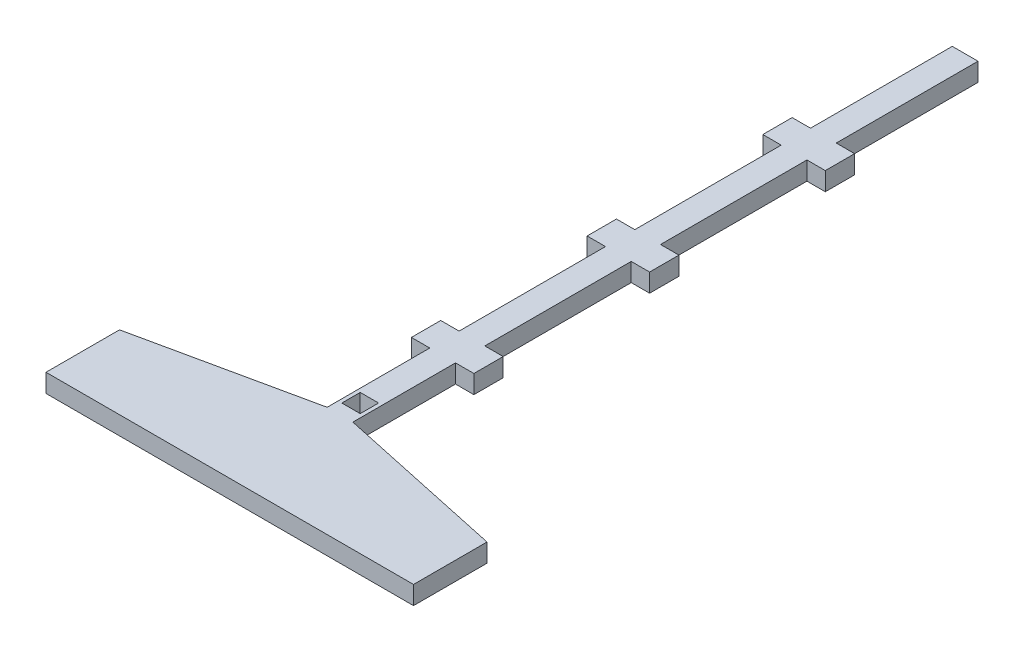
ISO-10303-21;
HEADER;
FILE_DESCRIPTION(('STEP AP214'),'2;1');
FILE_NAME('part.step','',(''),(''),'','','');
FILE_SCHEMA(('AUTOMOTIVE_DESIGN { 1 0 10303 214 1 1 1 1 }'));
ENDSEC;
DATA;
#1=APPLICATION_CONTEXT('core data for automotive mechanical design processes');
#2=APPLICATION_PROTOCOL_DEFINITION('international standard','automotive_design',2000,#1);
#3=PRODUCT_CONTEXT('',#1,'mechanical');
#4=PRODUCT('Part','Part','',(#3));
#5=PRODUCT_RELATED_PRODUCT_CATEGORY('part','',(#4));
#6=PRODUCT_DEFINITION_FORMATION('','',#4);
#7=PRODUCT_DEFINITION_CONTEXT('part definition',#1,'design');
#8=PRODUCT_DEFINITION('design','',#6,#7);
#9=PRODUCT_DEFINITION_SHAPE('','',#8);
#10=(LENGTH_UNIT() NAMED_UNIT(*) SI_UNIT(.MILLI.,.METRE.));
#11=(NAMED_UNIT(*) PLANE_ANGLE_UNIT() SI_UNIT($,.RADIAN.));
#12=(NAMED_UNIT(*) SI_UNIT($,.STERADIAN.) SOLID_ANGLE_UNIT());
#13=UNCERTAINTY_MEASURE_WITH_UNIT(LENGTH_MEASURE(1.E-05),#10,'distance_accuracy_value','');
#14=(GEOMETRIC_REPRESENTATION_CONTEXT(3) GLOBAL_UNCERTAINTY_ASSIGNED_CONTEXT((#13)) GLOBAL_UNIT_ASSIGNED_CONTEXT((#10,
#11,#12)) REPRESENTATION_CONTEXT('',''));
#15=CARTESIAN_POINT('',(0.,0.,0.));
#16=DIRECTION('',(0.,0.,1.));
#17=DIRECTION('',(1.,0.,0.));
#18=AXIS2_PLACEMENT_3D('',#15,#16,#17);
#19=CARTESIAN_POINT('',(0.,6.35,0.));
#20=DIRECTION('',(0.,1.,0.));
#21=DIRECTION('',(0.,0.,1.));
#22=AXIS2_PLACEMENT_3D('',#19,#20,#21);
#23=PLANE('',#22);
#24=DIRECTION('',(0.,0.,1.));
#25=VECTOR('',#24,1.);
#26=CARTESIAN_POINT('',(0.,6.35,0.));
#27=LINE('',#26,#25);
#28=CARTESIAN_POINT('',(0.,6.35,-25.4));
#29=VERTEX_POINT('',#28);
#30=CARTESIAN_POINT('',(0.,6.35,0.));
#31=VERTEX_POINT('',#30);
#32=EDGE_CURVE('E302',#29,#31,#27,.T.);
#33=ORIENTED_EDGE('',*,*,#32,.T.);
#34=DIRECTION('',(1.,0.,0.));
#35=VECTOR('',#34,1.);
#36=CARTESIAN_POINT('',(0.,6.35,0.));
#37=LINE('',#36,#35);
#38=CARTESIAN_POINT('',(127.,6.35,0.));
#39=VERTEX_POINT('',#38);
#40=EDGE_CURVE('E305',#31,#39,#37,.T.);
#41=ORIENTED_EDGE('',*,*,#40,.T.);
#42=DIRECTION('',(0.,0.,-1.));
#43=VECTOR('',#42,1.);
#44=CARTESIAN_POINT('',(127.,6.35,0.));
#45=LINE('',#44,#43);
#46=CARTESIAN_POINT('',(127.,6.35,-25.4));
#47=VERTEX_POINT('',#46);
#48=EDGE_CURVE('E308',#39,#47,#45,.T.);
#49=ORIENTED_EDGE('',*,*,#48,.T.);
#50=DIRECTION('',(-0.977648311294435,0.,-0.21024694866547));
#51=VECTOR('',#50,1.);
#52=CARTESIAN_POINT('',(67.945,6.35,-38.1));
#53=LINE('',#52,#51);
#54=CARTESIAN_POINT('',(67.945,6.35,-38.1));
#55=VERTEX_POINT('',#54);
#56=EDGE_CURVE('E310',#47,#55,#53,.T.);
#57=ORIENTED_EDGE('',*,*,#56,.T.);
#58=DIRECTION('',(0.,0.,-1.));
#59=VECTOR('',#58,1.);
#60=CARTESIAN_POINT('',(67.945,6.35,-38.1));
#61=LINE('',#60,#59);
#62=CARTESIAN_POINT('',(67.945,6.35,-73.566782));
#63=VERTEX_POINT('',#62);
#64=EDGE_CURVE('E312',#55,#63,#61,.T.);
#65=ORIENTED_EDGE('',*,*,#64,.T.);
#66=DIRECTION('',(1.,0.,0.));
#67=VECTOR('',#66,1.);
#68=CARTESIAN_POINT('',(67.945,6.35,-73.566782));
#69=LINE('',#68,#67);
#70=CARTESIAN_POINT('',(74.295,6.35,-73.566782));
#71=VERTEX_POINT('',#70);
#72=EDGE_CURVE('E314',#63,#71,#69,.T.);
#73=ORIENTED_EDGE('',*,*,#72,.T.);
#74=DIRECTION('',(0.,0.,-1.));
#75=VECTOR('',#74,1.);
#76=CARTESIAN_POINT('',(74.295,6.35,-73.566782));
#77=LINE('',#76,#75);
#78=CARTESIAN_POINT('',(74.295,6.35,-83.698651246));
#79=VERTEX_POINT('',#78);
#80=EDGE_CURVE('E316',#71,#79,#77,.T.);
#81=ORIENTED_EDGE('',*,*,#80,.T.);
#82=DIRECTION('',(-1.,0.,0.));
#83=VECTOR('',#82,1.);
#84=CARTESIAN_POINT('',(74.295,6.35,-83.698651246));
#85=LINE('',#84,#83);
#86=CARTESIAN_POINT('',(67.945,6.35,-83.698651246));
#87=VERTEX_POINT('',#86);
#88=EDGE_CURVE('E318',#79,#87,#85,.T.);
#89=ORIENTED_EDGE('',*,*,#88,.T.);
#90=DIRECTION('',(0.,0.,-1.));
#91=VECTOR('',#90,1.);
#92=CARTESIAN_POINT('',(67.945,6.35,-83.698651246));
#93=LINE('',#92,#91);
#94=CARTESIAN_POINT('',(67.945,6.35,-134.288657));
#95=VERTEX_POINT('',#94);
#96=EDGE_CURVE('E320',#87,#95,#93,.T.);
#97=ORIENTED_EDGE('',*,*,#96,.T.);
#98=DIRECTION('',(1.,0.,0.));
#99=VECTOR('',#98,1.);
#100=CARTESIAN_POINT('',(67.945,6.35,-134.288657));
#101=LINE('',#100,#99);
#102=CARTESIAN_POINT('',(74.295,6.35,-134.288657));
#103=VERTEX_POINT('',#102);
#104=EDGE_CURVE('E322',#95,#103,#101,.T.);
#105=ORIENTED_EDGE('',*,*,#104,.T.);
#106=DIRECTION('',(0.,0.,-1.));
#107=VECTOR('',#106,1.);
#108=CARTESIAN_POINT('',(74.295,6.35,-134.288657));
#109=LINE('',#108,#107);
#110=CARTESIAN_POINT('',(74.295,6.35,-144.420526246));
#111=VERTEX_POINT('',#110);
#112=EDGE_CURVE('E324',#103,#111,#109,.T.);
#113=ORIENTED_EDGE('',*,*,#112,.T.);
#114=DIRECTION('',(-1.,0.,0.));
#115=VECTOR('',#114,1.);
#116=CARTESIAN_POINT('',(74.295,6.35,-144.420526246));
#117=LINE('',#116,#115);
#118=CARTESIAN_POINT('',(67.945,6.35,-144.420526246));
#119=VERTEX_POINT('',#118);
#120=EDGE_CURVE('E326',#111,#119,#117,.T.);
#121=ORIENTED_EDGE('',*,*,#120,.T.);
#122=DIRECTION('',(0.,0.,-1.));
#123=VECTOR('',#122,1.);
#124=CARTESIAN_POINT('',(67.945,6.35,-144.420526246));
#125=LINE('',#124,#123);
#126=CARTESIAN_POINT('',(67.945,6.35,-195.010544446));
#127=VERTEX_POINT('',#126);
#128=EDGE_CURVE('E328',#119,#127,#125,.T.);
#129=ORIENTED_EDGE('',*,*,#128,.T.);
#130=DIRECTION('',(1.,0.,0.));
#131=VECTOR('',#130,1.);
#132=CARTESIAN_POINT('',(67.945,6.35,-195.010544446));
#133=LINE('',#132,#131);
#134=CARTESIAN_POINT('',(74.295,6.35,-195.010544446));
#135=VERTEX_POINT('',#134);
#136=EDGE_CURVE('E330',#127,#135,#133,.T.);
#137=ORIENTED_EDGE('',*,*,#136,.T.);
#138=DIRECTION('',(0.,0.,-1.));
#139=VECTOR('',#138,1.);
#140=CARTESIAN_POINT('',(74.295,6.35,-195.010544446));
#141=LINE('',#140,#139);
#142=CARTESIAN_POINT('',(74.295,6.35,-205.142413692));
#143=VERTEX_POINT('',#142);
#144=EDGE_CURVE('E332',#135,#143,#141,.T.);
#145=ORIENTED_EDGE('',*,*,#144,.T.);
#146=DIRECTION('',(-1.,0.,0.));
#147=VECTOR('',#146,1.);
#148=CARTESIAN_POINT('',(74.295,6.35,-205.142413692));
#149=LINE('',#148,#147);
#150=CARTESIAN_POINT('',(67.945,6.35,-205.142413692));
#151=VERTEX_POINT('',#150);
#152=EDGE_CURVE('E334',#143,#151,#149,.T.);
#153=ORIENTED_EDGE('',*,*,#152,.T.);
#154=DIRECTION('',(0.,0.,-1.));
#155=VECTOR('',#154,1.);
#156=CARTESIAN_POINT('',(67.945,6.35,-205.142413692));
#157=LINE('',#156,#155);
#158=CARTESIAN_POINT('',(67.945,6.35,-254.126831852));
#159=VERTEX_POINT('',#158);
#160=EDGE_CURVE('E336',#151,#159,#157,.T.);
#161=ORIENTED_EDGE('',*,*,#160,.T.);
#162=DIRECTION('',(-1.,0.,0.));
#163=VECTOR('',#162,1.);
#164=CARTESIAN_POINT('',(59.055,6.35,-254.126831852));
#165=LINE('',#164,#163);
#166=CARTESIAN_POINT('',(59.055,6.35,-254.126831852));
#167=VERTEX_POINT('',#166);
#168=EDGE_CURVE('E338',#159,#167,#165,.T.);
#169=ORIENTED_EDGE('',*,*,#168,.T.);
#170=DIRECTION('',(0.,0.,1.));
#171=VECTOR('',#170,1.);
#172=CARTESIAN_POINT('',(59.055,6.35,-205.142413692));
#173=LINE('',#172,#171);
#174=CARTESIAN_POINT('',(59.055,6.35,-205.142413692));
#175=VERTEX_POINT('',#174);
#176=EDGE_CURVE('E340',#167,#175,#173,.T.);
#177=ORIENTED_EDGE('',*,*,#176,.T.);
#178=DIRECTION('',(-1.,0.,0.));
#179=VECTOR('',#178,1.);
#180=CARTESIAN_POINT('',(52.705,6.35,-205.142413692));
#181=LINE('',#180,#179);
#182=CARTESIAN_POINT('',(52.705,6.35,-205.142413692));
#183=VERTEX_POINT('',#182);
#184=EDGE_CURVE('E342',#175,#183,#181,.T.);
#185=ORIENTED_EDGE('',*,*,#184,.T.);
#186=DIRECTION('',(0.,0.,1.));
#187=VECTOR('',#186,1.);
#188=CARTESIAN_POINT('',(52.705,6.35,-195.010544446));
#189=LINE('',#188,#187);
#190=CARTESIAN_POINT('',(52.705,6.35,-195.010544446));
#191=VERTEX_POINT('',#190);
#192=EDGE_CURVE('E344',#183,#191,#189,.T.);
#193=ORIENTED_EDGE('',*,*,#192,.T.);
#194=DIRECTION('',(1.,0.,0.));
#195=VECTOR('',#194,1.);
#196=CARTESIAN_POINT('',(59.055,6.35,-195.010544446));
#197=LINE('',#196,#195);
#198=CARTESIAN_POINT('',(59.055,6.35,-195.010544446));
#199=VERTEX_POINT('',#198);
#200=EDGE_CURVE('E346',#191,#199,#197,.T.);
#201=ORIENTED_EDGE('',*,*,#200,.T.);
#202=DIRECTION('',(0.,0.,1.));
#203=VECTOR('',#202,1.);
#204=CARTESIAN_POINT('',(59.055,6.35,-144.420526246));
#205=LINE('',#204,#203);
#206=CARTESIAN_POINT('',(59.055,6.35,-144.420526246));
#207=VERTEX_POINT('',#206);
#208=EDGE_CURVE('E348',#199,#207,#205,.T.);
#209=ORIENTED_EDGE('',*,*,#208,.T.);
#210=DIRECTION('',(-1.,0.,0.));
#211=VECTOR('',#210,1.);
#212=CARTESIAN_POINT('',(52.705,6.35,-144.420526246));
#213=LINE('',#212,#211);
#214=CARTESIAN_POINT('',(52.705,6.35,-144.420526246));
#215=VERTEX_POINT('',#214);
#216=EDGE_CURVE('E350',#207,#215,#213,.T.);
#217=ORIENTED_EDGE('',*,*,#216,.T.);
#218=DIRECTION('',(0.,0.,1.));
#219=VECTOR('',#218,1.);
#220=CARTESIAN_POINT('',(52.705,6.35,-134.288657));
#221=LINE('',#220,#219);
#222=CARTESIAN_POINT('',(52.705,6.35,-134.288657));
#223=VERTEX_POINT('',#222);
#224=EDGE_CURVE('E352',#215,#223,#221,.T.);
#225=ORIENTED_EDGE('',*,*,#224,.T.);
#226=DIRECTION('',(1.,0.,0.));
#227=VECTOR('',#226,1.);
#228=CARTESIAN_POINT('',(59.055,6.35,-134.288657));
#229=LINE('',#228,#227);
#230=CARTESIAN_POINT('',(59.055,6.35,-134.288657));
#231=VERTEX_POINT('',#230);
#232=EDGE_CURVE('E354',#223,#231,#229,.T.);
#233=ORIENTED_EDGE('',*,*,#232,.T.);
#234=DIRECTION('',(0.,0.,1.));
#235=VECTOR('',#234,1.);
#236=CARTESIAN_POINT('',(59.055,6.35,-83.698651246));
#237=LINE('',#236,#235);
#238=CARTESIAN_POINT('',(59.055,6.35,-83.698651246));
#239=VERTEX_POINT('',#238);
#240=EDGE_CURVE('E356',#231,#239,#237,.T.);
#241=ORIENTED_EDGE('',*,*,#240,.T.);
#242=DIRECTION('',(-1.,0.,0.));
#243=VECTOR('',#242,1.);
#244=CARTESIAN_POINT('',(52.705,6.35,-83.698651246));
#245=LINE('',#244,#243);
#246=CARTESIAN_POINT('',(52.705,6.35,-83.698651246));
#247=VERTEX_POINT('',#246);
#248=EDGE_CURVE('E358',#239,#247,#245,.T.);
#249=ORIENTED_EDGE('',*,*,#248,.T.);
#250=DIRECTION('',(0.,0.,1.));
#251=VECTOR('',#250,1.);
#252=CARTESIAN_POINT('',(52.705,6.35,-73.566782));
#253=LINE('',#252,#251);
#254=CARTESIAN_POINT('',(52.705,6.35,-73.566782));
#255=VERTEX_POINT('',#254);
#256=EDGE_CURVE('E360',#247,#255,#253,.T.);
#257=ORIENTED_EDGE('',*,*,#256,.T.);
#258=DIRECTION('',(1.,0.,0.));
#259=VECTOR('',#258,1.);
#260=CARTESIAN_POINT('',(59.055,6.35,-73.566782));
#261=LINE('',#260,#259);
#262=CARTESIAN_POINT('',(59.055,6.35,-73.566782));
#263=VERTEX_POINT('',#262);
#264=EDGE_CURVE('E362',#255,#263,#261,.T.);
#265=ORIENTED_EDGE('',*,*,#264,.T.);
#266=DIRECTION('',(0.,0.,1.));
#267=VECTOR('',#266,1.);
#268=CARTESIAN_POINT('',(59.055,6.35,-38.1));
#269=LINE('',#268,#267);
#270=CARTESIAN_POINT('',(59.055,6.35,-38.1));
#271=VERTEX_POINT('',#270);
#272=EDGE_CURVE('E364',#263,#271,#269,.T.);
#273=ORIENTED_EDGE('',*,*,#272,.T.);
#274=DIRECTION('',(-0.977648311294435,0.,0.21024694866547));
#275=VECTOR('',#274,1.);
#276=CARTESIAN_POINT('',(0.,6.35,-25.4));
#277=LINE('',#276,#275);
#278=EDGE_CURVE('E366',#271,#29,#277,.T.);
#279=ORIENTED_EDGE('',*,*,#278,.T.);
#280=EDGE_LOOP('',(#33,#41,#49,#57,#65,#73,#81,#89,#97,#105,#113,#121,#129,#137,#145,#153,#161,
#169,#177,#185,#193,#201,#209,#217,#225,#233,#241,#249,#257,#265,#273,#279));
#281=FACE_BOUND('',#280,.T.);
#282=DIRECTION('',(1.,0.,0.));
#283=VECTOR('',#282,1.);
#284=CARTESIAN_POINT('',(60.325,6.35,-41.91));
#285=LINE('',#284,#283);
#286=CARTESIAN_POINT('',(60.325,6.35,-41.91));
#287=VERTEX_POINT('',#286);
#288=CARTESIAN_POINT('',(66.675,6.35,-41.91));
#289=VERTEX_POINT('',#288);
#290=EDGE_CURVE('E274',#287,#289,#285,.T.);
#291=ORIENTED_EDGE('',*,*,#290,.F.);
#292=DIRECTION('',(0.,0.,1.));
#293=VECTOR('',#292,1.);
#294=CARTESIAN_POINT('',(60.325,6.35,-48.26));
#295=LINE('',#294,#293);
#296=CARTESIAN_POINT('',(60.325,6.35,-48.26));
#297=VERTEX_POINT('',#296);
#298=EDGE_CURVE('E266',#297,#287,#295,.T.);
#299=ORIENTED_EDGE('',*,*,#298,.F.);
#300=DIRECTION('',(-1.,0.,0.));
#301=VECTOR('',#300,1.);
#302=CARTESIAN_POINT('',(66.675,6.35,-48.26));
#303=LINE('',#302,#301);
#304=CARTESIAN_POINT('',(66.675,6.35,-48.26));
#305=VERTEX_POINT('',#304);
#306=EDGE_CURVE('E288',#305,#297,#303,.T.);
#307=ORIENTED_EDGE('',*,*,#306,.F.);
#308=DIRECTION('',(0.,0.,-1.));
#309=VECTOR('',#308,1.);
#310=CARTESIAN_POINT('',(66.675,6.35,-41.91));
#311=LINE('',#310,#309);
#312=EDGE_CURVE('E286',#289,#305,#311,.T.);
#313=ORIENTED_EDGE('',*,*,#312,.F.);
#314=EDGE_LOOP('',(#291,#299,#307,#313));
#315=FACE_BOUND('',#314,.T.);
#316=ADVANCED_FACE('F33',(#281,#315),#23,.T.);
#317=CARTESIAN_POINT('',(0.,0.,0.));
#318=DIRECTION('',(0.,1.,0.));
#319=DIRECTION('',(0.,0.,1.));
#320=AXIS2_PLACEMENT_3D('',#317,#318,#319);
#321=PLANE('',#320);
#322=DIRECTION('',(0.,0.,1.));
#323=VECTOR('',#322,1.);
#324=CARTESIAN_POINT('',(0.,0.,0.));
#325=LINE('',#324,#323);
#326=CARTESIAN_POINT('',(0.,0.,-25.4));
#327=VERTEX_POINT('',#326);
#328=CARTESIAN_POINT('',(0.,0.,0.));
#329=VERTEX_POINT('',#328);
#330=EDGE_CURVE('E282',#327,#329,#325,.T.);
#331=ORIENTED_EDGE('',*,*,#330,.F.);
#332=DIRECTION('',(-0.977648311294435,0.,0.21024694866547));
#333=VECTOR('',#332,1.);
#334=CARTESIAN_POINT('',(0.,0.,-25.4));
#335=LINE('',#334,#333);
#336=CARTESIAN_POINT('',(59.055,0.,-38.1));
#337=VERTEX_POINT('',#336);
#338=EDGE_CURVE('E306',#337,#327,#335,.T.);
#339=ORIENTED_EDGE('',*,*,#338,.F.);
#340=DIRECTION('',(0.,0.,1.));
#341=VECTOR('',#340,1.);
#342=CARTESIAN_POINT('',(59.055,0.,-38.1));
#343=LINE('',#342,#341);
#344=CARTESIAN_POINT('',(59.055,0.,-73.566782));
#345=VERTEX_POINT('',#344);
#346=EDGE_CURVE('E429',#345,#337,#343,.T.);
#347=ORIENTED_EDGE('',*,*,#346,.F.);
#348=DIRECTION('',(1.,0.,0.));
#349=VECTOR('',#348,1.);
#350=CARTESIAN_POINT('',(59.055,0.,-73.566782));
#351=LINE('',#350,#349);
#352=CARTESIAN_POINT('',(52.705,0.,-73.566782));
#353=VERTEX_POINT('',#352);
#354=EDGE_CURVE('E427',#353,#345,#351,.T.);
#355=ORIENTED_EDGE('',*,*,#354,.F.);
#356=DIRECTION('',(0.,0.,1.));
#357=VECTOR('',#356,1.);
#358=CARTESIAN_POINT('',(52.705,0.,-73.566782));
#359=LINE('',#358,#357);
#360=CARTESIAN_POINT('',(52.705,0.,-83.698651246));
#361=VERTEX_POINT('',#360);
#362=EDGE_CURVE('E425',#361,#353,#359,.T.);
#363=ORIENTED_EDGE('',*,*,#362,.F.);
#364=DIRECTION('',(-1.,0.,0.));
#365=VECTOR('',#364,1.);
#366=CARTESIAN_POINT('',(52.705,0.,-83.698651246));
#367=LINE('',#366,#365);
#368=CARTESIAN_POINT('',(59.055,0.,-83.698651246));
#369=VERTEX_POINT('',#368);
#370=EDGE_CURVE('E423',#369,#361,#367,.T.);
#371=ORIENTED_EDGE('',*,*,#370,.F.);
#372=DIRECTION('',(0.,0.,1.));
#373=VECTOR('',#372,1.);
#374=CARTESIAN_POINT('',(59.055,0.,-83.698651246));
#375=LINE('',#374,#373);
#376=CARTESIAN_POINT('',(59.055,0.,-134.288657));
#377=VERTEX_POINT('',#376);
#378=EDGE_CURVE('E421',#377,#369,#375,.T.);
#379=ORIENTED_EDGE('',*,*,#378,.F.);
#380=DIRECTION('',(1.,0.,0.));
#381=VECTOR('',#380,1.);
#382=CARTESIAN_POINT('',(59.055,0.,-134.288657));
#383=LINE('',#382,#381);
#384=CARTESIAN_POINT('',(52.705,0.,-134.288657));
#385=VERTEX_POINT('',#384);
#386=EDGE_CURVE('E419',#385,#377,#383,.T.);
#387=ORIENTED_EDGE('',*,*,#386,.F.);
#388=DIRECTION('',(0.,0.,1.));
#389=VECTOR('',#388,1.);
#390=CARTESIAN_POINT('',(52.705,0.,-134.288657));
#391=LINE('',#390,#389);
#392=CARTESIAN_POINT('',(52.705,0.,-144.420526246));
#393=VERTEX_POINT('',#392);
#394=EDGE_CURVE('E417',#393,#385,#391,.T.);
#395=ORIENTED_EDGE('',*,*,#394,.F.);
#396=DIRECTION('',(-1.,0.,0.));
#397=VECTOR('',#396,1.);
#398=CARTESIAN_POINT('',(52.705,0.,-144.420526246));
#399=LINE('',#398,#397);
#400=CARTESIAN_POINT('',(59.055,0.,-144.420526246));
#401=VERTEX_POINT('',#400);
#402=EDGE_CURVE('E415',#401,#393,#399,.T.);
#403=ORIENTED_EDGE('',*,*,#402,.F.);
#404=DIRECTION('',(0.,0.,1.));
#405=VECTOR('',#404,1.);
#406=CARTESIAN_POINT('',(59.055,0.,-144.420526246));
#407=LINE('',#406,#405);
#408=CARTESIAN_POINT('',(59.055,0.,-195.010544446));
#409=VERTEX_POINT('',#408);
#410=EDGE_CURVE('E413',#409,#401,#407,.T.);
#411=ORIENTED_EDGE('',*,*,#410,.F.);
#412=DIRECTION('',(1.,0.,0.));
#413=VECTOR('',#412,1.);
#414=CARTESIAN_POINT('',(59.055,0.,-195.010544446));
#415=LINE('',#414,#413);
#416=CARTESIAN_POINT('',(52.705,0.,-195.010544446));
#417=VERTEX_POINT('',#416);
#418=EDGE_CURVE('E411',#417,#409,#415,.T.);
#419=ORIENTED_EDGE('',*,*,#418,.F.);
#420=DIRECTION('',(0.,0.,1.));
#421=VECTOR('',#420,1.);
#422=CARTESIAN_POINT('',(52.705,0.,-195.010544446));
#423=LINE('',#422,#421);
#424=CARTESIAN_POINT('',(52.705,0.,-205.142413692));
#425=VERTEX_POINT('',#424);
#426=EDGE_CURVE('E409',#425,#417,#423,.T.);
#427=ORIENTED_EDGE('',*,*,#426,.F.);
#428=DIRECTION('',(-1.,0.,0.));
#429=VECTOR('',#428,1.);
#430=CARTESIAN_POINT('',(52.705,0.,-205.142413692));
#431=LINE('',#430,#429);
#432=CARTESIAN_POINT('',(59.055,0.,-205.142413692));
#433=VERTEX_POINT('',#432);
#434=EDGE_CURVE('E407',#433,#425,#431,.T.);
#435=ORIENTED_EDGE('',*,*,#434,.F.);
#436=DIRECTION('',(0.,0.,1.));
#437=VECTOR('',#436,1.);
#438=CARTESIAN_POINT('',(59.055,0.,-205.142413692));
#439=LINE('',#438,#437);
#440=CARTESIAN_POINT('',(59.055,0.,-254.126831852));
#441=VERTEX_POINT('',#440);
#442=EDGE_CURVE('E405',#441,#433,#439,.T.);
#443=ORIENTED_EDGE('',*,*,#442,.F.);
#444=DIRECTION('',(-1.,0.,0.));
#445=VECTOR('',#444,1.);
#446=CARTESIAN_POINT('',(59.055,0.,-254.126831852));
#447=LINE('',#446,#445);
#448=CARTESIAN_POINT('',(67.945,0.,-254.126831852));
#449=VERTEX_POINT('',#448);
#450=EDGE_CURVE('E403',#449,#441,#447,.T.);
#451=ORIENTED_EDGE('',*,*,#450,.F.);
#452=DIRECTION('',(0.,0.,-1.));
#453=VECTOR('',#452,1.);
#454=CARTESIAN_POINT('',(67.945,0.,-205.142413692));
#455=LINE('',#454,#453);
#456=CARTESIAN_POINT('',(67.945,0.,-205.142413692));
#457=VERTEX_POINT('',#456);
#458=EDGE_CURVE('E401',#457,#449,#455,.T.);
#459=ORIENTED_EDGE('',*,*,#458,.F.);
#460=DIRECTION('',(-1.,0.,0.));
#461=VECTOR('',#460,1.);
#462=CARTESIAN_POINT('',(74.295,0.,-205.142413692));
#463=LINE('',#462,#461);
#464=CARTESIAN_POINT('',(74.295,0.,-205.142413692));
#465=VERTEX_POINT('',#464);
#466=EDGE_CURVE('E399',#465,#457,#463,.T.);
#467=ORIENTED_EDGE('',*,*,#466,.F.);
#468=DIRECTION('',(0.,0.,-1.));
#469=VECTOR('',#468,1.);
#470=CARTESIAN_POINT('',(74.295,0.,-195.010544446));
#471=LINE('',#470,#469);
#472=CARTESIAN_POINT('',(74.295,0.,-195.010544446));
#473=VERTEX_POINT('',#472);
#474=EDGE_CURVE('E397',#473,#465,#471,.T.);
#475=ORIENTED_EDGE('',*,*,#474,.F.);
#476=DIRECTION('',(1.,0.,0.));
#477=VECTOR('',#476,1.);
#478=CARTESIAN_POINT('',(67.945,0.,-195.010544446));
#479=LINE('',#478,#477);
#480=CARTESIAN_POINT('',(67.945,0.,-195.010544446));
#481=VERTEX_POINT('',#480);
#482=EDGE_CURVE('E395',#481,#473,#479,.T.);
#483=ORIENTED_EDGE('',*,*,#482,.F.);
#484=DIRECTION('',(0.,0.,-1.));
#485=VECTOR('',#484,1.);
#486=CARTESIAN_POINT('',(67.945,0.,-144.420526246));
#487=LINE('',#486,#485);
#488=CARTESIAN_POINT('',(67.945,0.,-144.420526246));
#489=VERTEX_POINT('',#488);
#490=EDGE_CURVE('E393',#489,#481,#487,.T.);
#491=ORIENTED_EDGE('',*,*,#490,.F.);
#492=DIRECTION('',(-1.,0.,0.));
#493=VECTOR('',#492,1.);
#494=CARTESIAN_POINT('',(74.295,0.,-144.420526246));
#495=LINE('',#494,#493);
#496=CARTESIAN_POINT('',(74.295,0.,-144.420526246));
#497=VERTEX_POINT('',#496);
#498=EDGE_CURVE('E391',#497,#489,#495,.T.);
#499=ORIENTED_EDGE('',*,*,#498,.F.);
#500=DIRECTION('',(0.,0.,-1.));
#501=VECTOR('',#500,1.);
#502=CARTESIAN_POINT('',(74.295,0.,-134.288657));
#503=LINE('',#502,#501);
#504=CARTESIAN_POINT('',(74.295,0.,-134.288657));
#505=VERTEX_POINT('',#504);
#506=EDGE_CURVE('E389',#505,#497,#503,.T.);
#507=ORIENTED_EDGE('',*,*,#506,.F.);
#508=DIRECTION('',(1.,0.,0.));
#509=VECTOR('',#508,1.);
#510=CARTESIAN_POINT('',(67.945,0.,-134.288657));
#511=LINE('',#510,#509);
#512=CARTESIAN_POINT('',(67.945,0.,-134.288657));
#513=VERTEX_POINT('',#512);
#514=EDGE_CURVE('E387',#513,#505,#511,.T.);
#515=ORIENTED_EDGE('',*,*,#514,.F.);
#516=DIRECTION('',(0.,0.,-1.));
#517=VECTOR('',#516,1.);
#518=CARTESIAN_POINT('',(67.945,0.,-83.698651246));
#519=LINE('',#518,#517);
#520=CARTESIAN_POINT('',(67.945,0.,-83.698651246));
#521=VERTEX_POINT('',#520);
#522=EDGE_CURVE('E385',#521,#513,#519,.T.);
#523=ORIENTED_EDGE('',*,*,#522,.F.);
#524=DIRECTION('',(-1.,0.,0.));
#525=VECTOR('',#524,1.);
#526=CARTESIAN_POINT('',(74.295,0.,-83.698651246));
#527=LINE('',#526,#525);
#528=CARTESIAN_POINT('',(74.295,0.,-83.698651246));
#529=VERTEX_POINT('',#528);
#530=EDGE_CURVE('E383',#529,#521,#527,.T.);
#531=ORIENTED_EDGE('',*,*,#530,.F.);
#532=DIRECTION('',(0.,0.,-1.));
#533=VECTOR('',#532,1.);
#534=CARTESIAN_POINT('',(74.295,0.,-73.566782));
#535=LINE('',#534,#533);
#536=CARTESIAN_POINT('',(74.295,0.,-73.566782));
#537=VERTEX_POINT('',#536);
#538=EDGE_CURVE('E381',#537,#529,#535,.T.);
#539=ORIENTED_EDGE('',*,*,#538,.F.);
#540=DIRECTION('',(1.,0.,0.));
#541=VECTOR('',#540,1.);
#542=CARTESIAN_POINT('',(67.945,0.,-73.566782));
#543=LINE('',#542,#541);
#544=CARTESIAN_POINT('',(67.945,0.,-73.566782));
#545=VERTEX_POINT('',#544);
#546=EDGE_CURVE('E379',#545,#537,#543,.T.);
#547=ORIENTED_EDGE('',*,*,#546,.F.);
#548=DIRECTION('',(0.,0.,-1.));
#549=VECTOR('',#548,1.);
#550=CARTESIAN_POINT('',(67.945,0.,-38.1));
#551=LINE('',#550,#549);
#552=CARTESIAN_POINT('',(67.945,0.,-38.1));
#553=VERTEX_POINT('',#552);
#554=EDGE_CURVE('E377',#553,#545,#551,.T.);
#555=ORIENTED_EDGE('',*,*,#554,.F.);
#556=DIRECTION('',(-0.977648311294435,0.,-0.21024694866547));
#557=VECTOR('',#556,1.);
#558=CARTESIAN_POINT('',(67.945,0.,-38.1));
#559=LINE('',#558,#557);
#560=CARTESIAN_POINT('',(127.,0.,-25.4));
#561=VERTEX_POINT('',#560);
#562=EDGE_CURVE('E375',#561,#553,#559,.T.);
#563=ORIENTED_EDGE('',*,*,#562,.F.);
#564=DIRECTION('',(0.,0.,-1.));
#565=VECTOR('',#564,1.);
#566=CARTESIAN_POINT('',(127.,0.,0.));
#567=LINE('',#566,#565);
#568=CARTESIAN_POINT('',(127.,0.,0.));
#569=VERTEX_POINT('',#568);
#570=EDGE_CURVE('E373',#569,#561,#567,.T.);
#571=ORIENTED_EDGE('',*,*,#570,.F.);
#572=DIRECTION('',(1.,0.,0.));
#573=VECTOR('',#572,1.);
#574=CARTESIAN_POINT('',(0.,0.,0.));
#575=LINE('',#574,#573);
#576=EDGE_CURVE('E371',#329,#569,#575,.T.);
#577=ORIENTED_EDGE('',*,*,#576,.F.);
#578=EDGE_LOOP('',(#331,#339,#347,#355,#363,#371,#379,#387,#395,#403,#411,#419,#427,#435,#443,
#451,#459,#467,#475,#483,#491,#499,#507,#515,#523,#531,#539,#547,#555,#563,#571,#577));
#579=FACE_BOUND('',#578,.T.);
#580=DIRECTION('',(0.,0.,1.));
#581=VECTOR('',#580,1.);
#582=CARTESIAN_POINT('',(60.325,0.,-48.26));
#583=LINE('',#582,#581);
#584=CARTESIAN_POINT('',(60.325,0.,-48.26));
#585=VERTEX_POINT('',#584);
#586=CARTESIAN_POINT('',(60.325,0.,-41.91));
#587=VERTEX_POINT('',#586);
#588=EDGE_CURVE('E56',#585,#587,#583,.T.);
#589=ORIENTED_EDGE('',*,*,#588,.T.);
#590=DIRECTION('',(1.,0.,0.));
#591=VECTOR('',#590,1.);
#592=CARTESIAN_POINT('',(60.325,0.,-41.91));
#593=LINE('',#592,#591);
#594=CARTESIAN_POINT('',(66.675,0.,-41.91));
#595=VERTEX_POINT('',#594);
#596=EDGE_CURVE('E281',#587,#595,#593,.T.);
#597=ORIENTED_EDGE('',*,*,#596,.T.);
#598=DIRECTION('',(0.,0.,-1.));
#599=VECTOR('',#598,1.);
#600=CARTESIAN_POINT('',(66.675,0.,-41.91));
#601=LINE('',#600,#599);
#602=CARTESIAN_POINT('',(66.675,0.,-48.26));
#603=VERTEX_POINT('',#602);
#604=EDGE_CURVE('E294',#595,#603,#601,.T.);
#605=ORIENTED_EDGE('',*,*,#604,.T.);
#606=DIRECTION('',(-1.,0.,0.));
#607=VECTOR('',#606,1.);
#608=CARTESIAN_POINT('',(66.675,0.,-48.26));
#609=LINE('',#608,#607);
#610=EDGE_CURVE('E275',#603,#585,#609,.T.);
#611=ORIENTED_EDGE('',*,*,#610,.T.);
#612=EDGE_LOOP('',(#589,#597,#605,#611));
#613=FACE_BOUND('',#612,.T.);
#614=ADVANCED_FACE('F531',(#579,#613),#321,.F.);
#615=CARTESIAN_POINT('',(0.,6.35,0.));
#616=DIRECTION('',(1.,0.,0.));
#617=DIRECTION('',(0.,0.,-1.));
#618=AXIS2_PLACEMENT_3D('',#615,#616,#617);
#619=PLANE('',#618);
#620=ORIENTED_EDGE('',*,*,#330,.T.);
#621=DIRECTION('',(0.,-1.,0.));
#622=VECTOR('',#621,1.);
#623=CARTESIAN_POINT('',(0.,6.35,0.));
#624=LINE('',#623,#622);
#625=EDGE_CURVE('E11',#31,#329,#624,.T.);
#626=ORIENTED_EDGE('',*,*,#625,.F.);
#627=ORIENTED_EDGE('',*,*,#32,.F.);
#628=DIRECTION('',(0.,-1.,0.));
#629=VECTOR('',#628,1.);
#630=CARTESIAN_POINT('',(0.,6.35,-25.4));
#631=LINE('',#630,#629);
#632=EDGE_CURVE('E368',#29,#327,#631,.T.);
#633=ORIENTED_EDGE('',*,*,#632,.T.);
#634=EDGE_LOOP('',(#620,#626,#627,#633));
#635=FACE_BOUND('',#634,.T.);
#636=ADVANCED_FACE('F35',(#635),#619,.F.);
#637=CARTESIAN_POINT('',(0.,6.35,0.));
#638=DIRECTION('',(0.,0.,-1.));
#639=DIRECTION('',(-1.,0.,0.));
#640=AXIS2_PLACEMENT_3D('',#637,#638,#639);
#641=PLANE('',#640);
#642=ORIENTED_EDGE('',*,*,#576,.T.);
#643=DIRECTION('',(0.,-1.,0.));
#644=VECTOR('',#643,1.);
#645=CARTESIAN_POINT('',(127.,6.35,0.));
#646=LINE('',#645,#644);
#647=EDGE_CURVE('E41',#39,#569,#646,.T.);
#648=ORIENTED_EDGE('',*,*,#647,.F.);
#649=ORIENTED_EDGE('',*,*,#40,.F.);
#650=ORIENTED_EDGE('',*,*,#625,.T.);
#651=EDGE_LOOP('',(#642,#648,#649,#650));
#652=FACE_BOUND('',#651,.T.);
#653=ADVANCED_FACE('F548',(#652),#641,.F.);
#654=CARTESIAN_POINT('',(127.,6.35,0.));
#655=DIRECTION('',(-1.,0.,0.));
#656=DIRECTION('',(0.,0.,1.));
#657=AXIS2_PLACEMENT_3D('',#654,#655,#656);
#658=PLANE('',#657);
#659=ORIENTED_EDGE('',*,*,#570,.T.);
#660=DIRECTION('',(0.,-1.,0.));
#661=VECTOR('',#660,1.);
#662=CARTESIAN_POINT('',(127.,6.35,-25.4));
#663=LINE('',#662,#661);
#664=EDGE_CURVE('E518',#47,#561,#663,.T.);
#665=ORIENTED_EDGE('',*,*,#664,.F.);
#666=ORIENTED_EDGE('',*,*,#48,.F.);
#667=ORIENTED_EDGE('',*,*,#647,.T.);
#668=EDGE_LOOP('',(#659,#665,#666,#667));
#669=FACE_BOUND('',#668,.T.);
#670=ADVANCED_FACE('F525',(#669),#658,.F.);
#671=CARTESIAN_POINT('',(67.945,6.35,-38.1));
#672=DIRECTION('',(-0.21024694866547,0.,0.977648311294434));
#673=DIRECTION('',(0.977648311294435,0.,0.21024694866547));
#674=AXIS2_PLACEMENT_3D('',#671,#672,#673);
#675=PLANE('',#674);
#676=ORIENTED_EDGE('',*,*,#562,.T.);
#677=DIRECTION('',(0.,-1.,0.));
#678=VECTOR('',#677,1.);
#679=CARTESIAN_POINT('',(67.945,6.35,-38.1));
#680=LINE('',#679,#678);
#681=EDGE_CURVE('E515',#55,#553,#680,.T.);
#682=ORIENTED_EDGE('',*,*,#681,.F.);
#683=ORIENTED_EDGE('',*,*,#56,.F.);
#684=ORIENTED_EDGE('',*,*,#664,.T.);
#685=EDGE_LOOP('',(#676,#682,#683,#684));
#686=FACE_BOUND('',#685,.T.);
#687=ADVANCED_FACE('F537',(#686),#675,.F.);
#688=CARTESIAN_POINT('',(67.945,6.35,-38.1));
#689=DIRECTION('',(-1.,0.,0.));
#690=DIRECTION('',(0.,0.,1.));
#691=AXIS2_PLACEMENT_3D('',#688,#689,#690);
#692=PLANE('',#691);
#693=ORIENTED_EDGE('',*,*,#554,.T.);
#694=DIRECTION('',(0.,-1.,0.));
#695=VECTOR('',#694,1.);
#696=CARTESIAN_POINT('',(67.945,6.35,-73.566782));
#697=LINE('',#696,#695);
#698=EDGE_CURVE('E512',#63,#545,#697,.T.);
#699=ORIENTED_EDGE('',*,*,#698,.F.);
#700=ORIENTED_EDGE('',*,*,#64,.F.);
#701=ORIENTED_EDGE('',*,*,#681,.T.);
#702=EDGE_LOOP('',(#693,#699,#700,#701));
#703=FACE_BOUND('',#702,.T.);
#704=ADVANCED_FACE('F541',(#703),#692,.F.);
#705=CARTESIAN_POINT('',(67.945,6.35,-73.566782));
#706=DIRECTION('',(0.,0.,-1.));
#707=DIRECTION('',(-1.,0.,0.));
#708=AXIS2_PLACEMENT_3D('',#705,#706,#707);
#709=PLANE('',#708);
#710=ORIENTED_EDGE('',*,*,#546,.T.);
#711=DIRECTION('',(0.,-1.,0.));
#712=VECTOR('',#711,1.);
#713=CARTESIAN_POINT('',(74.295,6.35,-73.566782));
#714=LINE('',#713,#712);
#715=EDGE_CURVE('E509',#71,#537,#714,.T.);
#716=ORIENTED_EDGE('',*,*,#715,.F.);
#717=ORIENTED_EDGE('',*,*,#72,.F.);
#718=ORIENTED_EDGE('',*,*,#698,.T.);
#719=EDGE_LOOP('',(#710,#716,#717,#718));
#720=FACE_BOUND('',#719,.T.);
#721=ADVANCED_FACE('F681',(#720),#709,.F.);
#722=CARTESIAN_POINT('',(74.295,6.35,-73.566782));
#723=DIRECTION('',(-1.,0.,0.));
#724=DIRECTION('',(0.,0.,1.));
#725=AXIS2_PLACEMENT_3D('',#722,#723,#724);
#726=PLANE('',#725);
#727=ORIENTED_EDGE('',*,*,#538,.T.);
#728=DIRECTION('',(0.,-1.,0.));
#729=VECTOR('',#728,1.);
#730=CARTESIAN_POINT('',(74.295,6.35,-83.698651246));
#731=LINE('',#730,#729);
#732=EDGE_CURVE('E506',#79,#529,#731,.T.);
#733=ORIENTED_EDGE('',*,*,#732,.F.);
#734=ORIENTED_EDGE('',*,*,#80,.F.);
#735=ORIENTED_EDGE('',*,*,#715,.T.);
#736=EDGE_LOOP('',(#727,#733,#734,#735));
#737=FACE_BOUND('',#736,.T.);
#738=ADVANCED_FACE('F679',(#737),#726,.F.);
#739=CARTESIAN_POINT('',(74.295,6.35,-83.698651246));
#740=DIRECTION('',(0.,0.,1.));
#741=DIRECTION('',(1.,0.,0.));
#742=AXIS2_PLACEMENT_3D('',#739,#740,#741);
#743=PLANE('',#742);
#744=ORIENTED_EDGE('',*,*,#530,.T.);
#745=DIRECTION('',(0.,-1.,0.));
#746=VECTOR('',#745,1.);
#747=CARTESIAN_POINT('',(67.945,6.35,-83.698651246));
#748=LINE('',#747,#746);
#749=EDGE_CURVE('E503',#87,#521,#748,.T.);
#750=ORIENTED_EDGE('',*,*,#749,.F.);
#751=ORIENTED_EDGE('',*,*,#88,.F.);
#752=ORIENTED_EDGE('',*,*,#732,.T.);
#753=EDGE_LOOP('',(#744,#750,#751,#752));
#754=FACE_BOUND('',#753,.T.);
#755=ADVANCED_FACE('F674',(#754),#743,.F.);
#756=CARTESIAN_POINT('',(67.945,6.35,-83.698651246));
#757=DIRECTION('',(-1.,0.,0.));
#758=DIRECTION('',(0.,0.,1.));
#759=AXIS2_PLACEMENT_3D('',#756,#757,#758);
#760=PLANE('',#759);
#761=ORIENTED_EDGE('',*,*,#522,.T.);
#762=DIRECTION('',(0.,-1.,0.));
#763=VECTOR('',#762,1.);
#764=CARTESIAN_POINT('',(67.945,6.35,-134.288657));
#765=LINE('',#764,#763);
#766=EDGE_CURVE('E500',#95,#513,#765,.T.);
#767=ORIENTED_EDGE('',*,*,#766,.F.);
#768=ORIENTED_EDGE('',*,*,#96,.F.);
#769=ORIENTED_EDGE('',*,*,#749,.T.);
#770=EDGE_LOOP('',(#761,#767,#768,#769));
#771=FACE_BOUND('',#770,.T.);
#772=ADVANCED_FACE('F669',(#771),#760,.F.);
#773=CARTESIAN_POINT('',(67.945,6.35,-134.288657));
#774=DIRECTION('',(0.,0.,-1.));
#775=DIRECTION('',(-1.,0.,0.));
#776=AXIS2_PLACEMENT_3D('',#773,#774,#775);
#777=PLANE('',#776);
#778=ORIENTED_EDGE('',*,*,#514,.T.);
#779=DIRECTION('',(0.,-1.,0.));
#780=VECTOR('',#779,1.);
#781=CARTESIAN_POINT('',(74.295,6.35,-134.288657));
#782=LINE('',#781,#780);
#783=EDGE_CURVE('E497',#103,#505,#782,.T.);
#784=ORIENTED_EDGE('',*,*,#783,.F.);
#785=ORIENTED_EDGE('',*,*,#104,.F.);
#786=ORIENTED_EDGE('',*,*,#766,.T.);
#787=EDGE_LOOP('',(#778,#784,#785,#786));
#788=FACE_BOUND('',#787,.T.);
#789=ADVANCED_FACE('F665',(#788),#777,.F.);
#790=CARTESIAN_POINT('',(74.295,6.35,-134.288657));
#791=DIRECTION('',(-1.,0.,0.));
#792=DIRECTION('',(0.,0.,1.));
#793=AXIS2_PLACEMENT_3D('',#790,#791,#792);
#794=PLANE('',#793);
#795=ORIENTED_EDGE('',*,*,#506,.T.);
#796=DIRECTION('',(0.,-1.,0.));
#797=VECTOR('',#796,1.);
#798=CARTESIAN_POINT('',(74.295,6.35,-144.420526246));
#799=LINE('',#798,#797);
#800=EDGE_CURVE('E494',#111,#497,#799,.T.);
#801=ORIENTED_EDGE('',*,*,#800,.F.);
#802=ORIENTED_EDGE('',*,*,#112,.F.);
#803=ORIENTED_EDGE('',*,*,#783,.T.);
#804=EDGE_LOOP('',(#795,#801,#802,#803));
#805=FACE_BOUND('',#804,.T.);
#806=ADVANCED_FACE('F660',(#805),#794,.F.);
#807=CARTESIAN_POINT('',(74.295,6.35,-144.420526246));
#808=DIRECTION('',(0.,0.,1.));
#809=DIRECTION('',(1.,0.,0.));
#810=AXIS2_PLACEMENT_3D('',#807,#808,#809);
#811=PLANE('',#810);
#812=ORIENTED_EDGE('',*,*,#498,.T.);
#813=DIRECTION('',(0.,-1.,0.));
#814=VECTOR('',#813,1.);
#815=CARTESIAN_POINT('',(67.945,6.35,-144.420526246));
#816=LINE('',#815,#814);
#817=EDGE_CURVE('E491',#119,#489,#816,.T.);
#818=ORIENTED_EDGE('',*,*,#817,.F.);
#819=ORIENTED_EDGE('',*,*,#120,.F.);
#820=ORIENTED_EDGE('',*,*,#800,.T.);
#821=EDGE_LOOP('',(#812,#818,#819,#820));
#822=FACE_BOUND('',#821,.T.);
#823=ADVANCED_FACE('F654',(#822),#811,.F.);
#824=CARTESIAN_POINT('',(67.945,6.35,-144.420526246));
#825=DIRECTION('',(-1.,0.,0.));
#826=DIRECTION('',(0.,0.,1.));
#827=AXIS2_PLACEMENT_3D('',#824,#825,#826);
#828=PLANE('',#827);
#829=ORIENTED_EDGE('',*,*,#490,.T.);
#830=DIRECTION('',(0.,-1.,0.));
#831=VECTOR('',#830,1.);
#832=CARTESIAN_POINT('',(67.945,6.35,-195.010544446));
#833=LINE('',#832,#831);
#834=EDGE_CURVE('E488',#127,#481,#833,.T.);
#835=ORIENTED_EDGE('',*,*,#834,.F.);
#836=ORIENTED_EDGE('',*,*,#128,.F.);
#837=ORIENTED_EDGE('',*,*,#817,.T.);
#838=EDGE_LOOP('',(#829,#835,#836,#837));
#839=FACE_BOUND('',#838,.T.);
#840=ADVANCED_FACE('F650',(#839),#828,.F.);
#841=CARTESIAN_POINT('',(67.945,6.35,-195.010544446));
#842=DIRECTION('',(0.,0.,-1.));
#843=DIRECTION('',(-1.,0.,0.));
#844=AXIS2_PLACEMENT_3D('',#841,#842,#843);
#845=PLANE('',#844);
#846=ORIENTED_EDGE('',*,*,#482,.T.);
#847=DIRECTION('',(0.,-1.,0.));
#848=VECTOR('',#847,1.);
#849=CARTESIAN_POINT('',(74.295,6.35,-195.010544446));
#850=LINE('',#849,#848);
#851=EDGE_CURVE('E485',#135,#473,#850,.T.);
#852=ORIENTED_EDGE('',*,*,#851,.F.);
#853=ORIENTED_EDGE('',*,*,#136,.F.);
#854=ORIENTED_EDGE('',*,*,#834,.T.);
#855=EDGE_LOOP('',(#846,#852,#853,#854));
#856=FACE_BOUND('',#855,.T.);
#857=ADVANCED_FACE('F645',(#856),#845,.F.);
#858=CARTESIAN_POINT('',(74.295,6.35,-195.010544446));
#859=DIRECTION('',(-1.,0.,0.));
#860=DIRECTION('',(0.,0.,1.));
#861=AXIS2_PLACEMENT_3D('',#858,#859,#860);
#862=PLANE('',#861);
#863=ORIENTED_EDGE('',*,*,#474,.T.);
#864=DIRECTION('',(0.,-1.,0.));
#865=VECTOR('',#864,1.);
#866=CARTESIAN_POINT('',(74.295,6.35,-205.142413692));
#867=LINE('',#866,#865);
#868=EDGE_CURVE('E482',#143,#465,#867,.T.);
#869=ORIENTED_EDGE('',*,*,#868,.F.);
#870=ORIENTED_EDGE('',*,*,#144,.F.);
#871=ORIENTED_EDGE('',*,*,#851,.T.);
#872=EDGE_LOOP('',(#863,#869,#870,#871));
#873=FACE_BOUND('',#872,.T.);
#874=ADVANCED_FACE('F639',(#873),#862,.F.);
#875=CARTESIAN_POINT('',(74.295,6.35,-205.142413692));
#876=DIRECTION('',(0.,0.,1.));
#877=DIRECTION('',(1.,0.,0.));
#878=AXIS2_PLACEMENT_3D('',#875,#876,#877);
#879=PLANE('',#878);
#880=ORIENTED_EDGE('',*,*,#466,.T.);
#881=DIRECTION('',(0.,-1.,0.));
#882=VECTOR('',#881,1.);
#883=CARTESIAN_POINT('',(67.945,6.35,-205.142413692));
#884=LINE('',#883,#882);
#885=EDGE_CURVE('E479',#151,#457,#884,.T.);
#886=ORIENTED_EDGE('',*,*,#885,.F.);
#887=ORIENTED_EDGE('',*,*,#152,.F.);
#888=ORIENTED_EDGE('',*,*,#868,.T.);
#889=EDGE_LOOP('',(#880,#886,#887,#888));
#890=FACE_BOUND('',#889,.T.);
#891=ADVANCED_FACE('F635',(#890),#879,.F.);
#892=CARTESIAN_POINT('',(67.945,6.35,-205.142413692));
#893=DIRECTION('',(-1.,0.,0.));
#894=DIRECTION('',(0.,0.,1.));
#895=AXIS2_PLACEMENT_3D('',#892,#893,#894);
#896=PLANE('',#895);
#897=ORIENTED_EDGE('',*,*,#458,.T.);
#898=DIRECTION('',(0.,-1.,0.));
#899=VECTOR('',#898,1.);
#900=CARTESIAN_POINT('',(67.945,6.35,-254.126831852));
#901=LINE('',#900,#899);
#902=EDGE_CURVE('E476',#159,#449,#901,.T.);
#903=ORIENTED_EDGE('',*,*,#902,.F.);
#904=ORIENTED_EDGE('',*,*,#160,.F.);
#905=ORIENTED_EDGE('',*,*,#885,.T.);
#906=EDGE_LOOP('',(#897,#903,#904,#905));
#907=FACE_BOUND('',#906,.T.);
#908=ADVANCED_FACE('F630',(#907),#896,.F.);
#909=CARTESIAN_POINT('',(59.055,6.35,-254.126831852));
#910=DIRECTION('',(0.,0.,1.));
#911=DIRECTION('',(1.,0.,0.));
#912=AXIS2_PLACEMENT_3D('',#909,#910,#911);
#913=PLANE('',#912);
#914=ORIENTED_EDGE('',*,*,#450,.T.);
#915=DIRECTION('',(0.,-1.,0.));
#916=VECTOR('',#915,1.);
#917=CARTESIAN_POINT('',(59.055,6.35,-254.126831852));
#918=LINE('',#917,#916);
#919=EDGE_CURVE('E473',#167,#441,#918,.T.);
#920=ORIENTED_EDGE('',*,*,#919,.F.);
#921=ORIENTED_EDGE('',*,*,#168,.F.);
#922=ORIENTED_EDGE('',*,*,#902,.T.);
#923=EDGE_LOOP('',(#914,#920,#921,#922));
#924=FACE_BOUND('',#923,.T.);
#925=ADVANCED_FACE('F624',(#924),#913,.F.);
#926=CARTESIAN_POINT('',(59.055,6.35,-205.142413692));
#927=DIRECTION('',(1.,0.,0.));
#928=DIRECTION('',(0.,0.,-1.));
#929=AXIS2_PLACEMENT_3D('',#926,#927,#928);
#930=PLANE('',#929);
#931=ORIENTED_EDGE('',*,*,#442,.T.);
#932=DIRECTION('',(0.,-1.,0.));
#933=VECTOR('',#932,1.);
#934=CARTESIAN_POINT('',(59.055,6.35,-205.142413692));
#935=LINE('',#934,#933);
#936=EDGE_CURVE('E470',#175,#433,#935,.T.);
#937=ORIENTED_EDGE('',*,*,#936,.F.);
#938=ORIENTED_EDGE('',*,*,#176,.F.);
#939=ORIENTED_EDGE('',*,*,#919,.T.);
#940=EDGE_LOOP('',(#931,#937,#938,#939));
#941=FACE_BOUND('',#940,.T.);
#942=ADVANCED_FACE('F620',(#941),#930,.F.);
#943=CARTESIAN_POINT('',(52.705,6.35,-205.142413692));
#944=DIRECTION('',(0.,0.,1.));
#945=DIRECTION('',(1.,0.,0.));
#946=AXIS2_PLACEMENT_3D('',#943,#944,#945);
#947=PLANE('',#946);
#948=ORIENTED_EDGE('',*,*,#434,.T.);
#949=DIRECTION('',(0.,-1.,0.));
#950=VECTOR('',#949,1.);
#951=CARTESIAN_POINT('',(52.705,6.35,-205.142413692));
#952=LINE('',#951,#950);
#953=EDGE_CURVE('E467',#183,#425,#952,.T.);
#954=ORIENTED_EDGE('',*,*,#953,.F.);
#955=ORIENTED_EDGE('',*,*,#184,.F.);
#956=ORIENTED_EDGE('',*,*,#936,.T.);
#957=EDGE_LOOP('',(#948,#954,#955,#956));
#958=FACE_BOUND('',#957,.T.);
#959=ADVANCED_FACE('F615',(#958),#947,.F.);
#960=CARTESIAN_POINT('',(52.705,6.35,-195.010544446));
#961=DIRECTION('',(1.,0.,0.));
#962=DIRECTION('',(0.,0.,-1.));
#963=AXIS2_PLACEMENT_3D('',#960,#961,#962);
#964=PLANE('',#963);
#965=ORIENTED_EDGE('',*,*,#426,.T.);
#966=DIRECTION('',(0.,-1.,0.));
#967=VECTOR('',#966,1.);
#968=CARTESIAN_POINT('',(52.705,6.35,-195.010544446));
#969=LINE('',#968,#967);
#970=EDGE_CURVE('E464',#191,#417,#969,.T.);
#971=ORIENTED_EDGE('',*,*,#970,.F.);
#972=ORIENTED_EDGE('',*,*,#192,.F.);
#973=ORIENTED_EDGE('',*,*,#953,.T.);
#974=EDGE_LOOP('',(#965,#971,#972,#973));
#975=FACE_BOUND('',#974,.T.);
#976=ADVANCED_FACE('F609',(#975),#964,.F.);
#977=CARTESIAN_POINT('',(59.055,6.35,-195.010544446));
#978=DIRECTION('',(0.,0.,-1.));
#979=DIRECTION('',(-1.,0.,0.));
#980=AXIS2_PLACEMENT_3D('',#977,#978,#979);
#981=PLANE('',#980);
#982=ORIENTED_EDGE('',*,*,#418,.T.);
#983=DIRECTION('',(0.,-1.,0.));
#984=VECTOR('',#983,1.);
#985=CARTESIAN_POINT('',(59.055,6.35,-195.010544446));
#986=LINE('',#985,#984);
#987=EDGE_CURVE('E461',#199,#409,#986,.T.);
#988=ORIENTED_EDGE('',*,*,#987,.F.);
#989=ORIENTED_EDGE('',*,*,#200,.F.);
#990=ORIENTED_EDGE('',*,*,#970,.T.);
#991=EDGE_LOOP('',(#982,#988,#989,#990));
#992=FACE_BOUND('',#991,.T.);
#993=ADVANCED_FACE('F605',(#992),#981,.F.);
#994=CARTESIAN_POINT('',(59.055,6.35,-144.420526246));
#995=DIRECTION('',(1.,0.,0.));
#996=DIRECTION('',(0.,0.,-1.));
#997=AXIS2_PLACEMENT_3D('',#994,#995,#996);
#998=PLANE('',#997);
#999=ORIENTED_EDGE('',*,*,#410,.T.);
#1000=DIRECTION('',(0.,-1.,0.));
#1001=VECTOR('',#1000,1.);
#1002=CARTESIAN_POINT('',(59.055,6.35,-144.420526246));
#1003=LINE('',#1002,#1001);
#1004=EDGE_CURVE('E458',#207,#401,#1003,.T.);
#1005=ORIENTED_EDGE('',*,*,#1004,.F.);
#1006=ORIENTED_EDGE('',*,*,#208,.F.);
#1007=ORIENTED_EDGE('',*,*,#987,.T.);
#1008=EDGE_LOOP('',(#999,#1005,#1006,#1007));
#1009=FACE_BOUND('',#1008,.T.);
#1010=ADVANCED_FACE('F600',(#1009),#998,.F.);
#1011=CARTESIAN_POINT('',(52.705,6.35,-144.420526246));
#1012=DIRECTION('',(0.,0.,1.));
#1013=DIRECTION('',(1.,0.,0.));
#1014=AXIS2_PLACEMENT_3D('',#1011,#1012,#1013);
#1015=PLANE('',#1014);
#1016=ORIENTED_EDGE('',*,*,#402,.T.);
#1017=DIRECTION('',(0.,-1.,0.));
#1018=VECTOR('',#1017,1.);
#1019=CARTESIAN_POINT('',(52.705,6.35,-144.420526246));
#1020=LINE('',#1019,#1018);
#1021=EDGE_CURVE('E455',#215,#393,#1020,.T.);
#1022=ORIENTED_EDGE('',*,*,#1021,.F.);
#1023=ORIENTED_EDGE('',*,*,#216,.F.);
#1024=ORIENTED_EDGE('',*,*,#1004,.T.);
#1025=EDGE_LOOP('',(#1016,#1022,#1023,#1024));
#1026=FACE_BOUND('',#1025,.T.);
#1027=ADVANCED_FACE('F594',(#1026),#1015,.F.);
#1028=CARTESIAN_POINT('',(52.705,6.35,-134.288657));
#1029=DIRECTION('',(1.,0.,0.));
#1030=DIRECTION('',(0.,0.,-1.));
#1031=AXIS2_PLACEMENT_3D('',#1028,#1029,#1030);
#1032=PLANE('',#1031);
#1033=ORIENTED_EDGE('',*,*,#394,.T.);
#1034=DIRECTION('',(0.,-1.,0.));
#1035=VECTOR('',#1034,1.);
#1036=CARTESIAN_POINT('',(52.705,6.35,-134.288657));
#1037=LINE('',#1036,#1035);
#1038=EDGE_CURVE('E452',#223,#385,#1037,.T.);
#1039=ORIENTED_EDGE('',*,*,#1038,.F.);
#1040=ORIENTED_EDGE('',*,*,#224,.F.);
#1041=ORIENTED_EDGE('',*,*,#1021,.T.);
#1042=EDGE_LOOP('',(#1033,#1039,#1040,#1041));
#1043=FACE_BOUND('',#1042,.T.);
#1044=ADVANCED_FACE('F590',(#1043),#1032,.F.);
#1045=CARTESIAN_POINT('',(59.055,6.35,-134.288657));
#1046=DIRECTION('',(0.,0.,-1.));
#1047=DIRECTION('',(-1.,0.,0.));
#1048=AXIS2_PLACEMENT_3D('',#1045,#1046,#1047);
#1049=PLANE('',#1048);
#1050=ORIENTED_EDGE('',*,*,#386,.T.);
#1051=DIRECTION('',(0.,-1.,0.));
#1052=VECTOR('',#1051,1.);
#1053=CARTESIAN_POINT('',(59.055,6.35,-134.288657));
#1054=LINE('',#1053,#1052);
#1055=EDGE_CURVE('E449',#231,#377,#1054,.T.);
#1056=ORIENTED_EDGE('',*,*,#1055,.F.);
#1057=ORIENTED_EDGE('',*,*,#232,.F.);
#1058=ORIENTED_EDGE('',*,*,#1038,.T.);
#1059=EDGE_LOOP('',(#1050,#1056,#1057,#1058));
#1060=FACE_BOUND('',#1059,.T.);
#1061=ADVANCED_FACE('F585',(#1060),#1049,.F.);
#1062=CARTESIAN_POINT('',(59.055,6.35,-83.698651246));
#1063=DIRECTION('',(1.,0.,0.));
#1064=DIRECTION('',(0.,0.,-1.));
#1065=AXIS2_PLACEMENT_3D('',#1062,#1063,#1064);
#1066=PLANE('',#1065);
#1067=ORIENTED_EDGE('',*,*,#378,.T.);
#1068=DIRECTION('',(0.,-1.,0.));
#1069=VECTOR('',#1068,1.);
#1070=CARTESIAN_POINT('',(59.055,6.35,-83.698651246));
#1071=LINE('',#1070,#1069);
#1072=EDGE_CURVE('E446',#239,#369,#1071,.T.);
#1073=ORIENTED_EDGE('',*,*,#1072,.F.);
#1074=ORIENTED_EDGE('',*,*,#240,.F.);
#1075=ORIENTED_EDGE('',*,*,#1055,.T.);
#1076=EDGE_LOOP('',(#1067,#1073,#1074,#1075));
#1077=FACE_BOUND('',#1076,.T.);
#1078=ADVANCED_FACE('F579',(#1077),#1066,.F.);
#1079=CARTESIAN_POINT('',(52.705,6.35,-83.698651246));
#1080=DIRECTION('',(0.,0.,1.));
#1081=DIRECTION('',(1.,0.,0.));
#1082=AXIS2_PLACEMENT_3D('',#1079,#1080,#1081);
#1083=PLANE('',#1082);
#1084=ORIENTED_EDGE('',*,*,#370,.T.);
#1085=DIRECTION('',(0.,-1.,0.));
#1086=VECTOR('',#1085,1.);
#1087=CARTESIAN_POINT('',(52.705,6.35,-83.698651246));
#1088=LINE('',#1087,#1086);
#1089=EDGE_CURVE('E443',#247,#361,#1088,.T.);
#1090=ORIENTED_EDGE('',*,*,#1089,.F.);
#1091=ORIENTED_EDGE('',*,*,#248,.F.);
#1092=ORIENTED_EDGE('',*,*,#1072,.T.);
#1093=EDGE_LOOP('',(#1084,#1090,#1091,#1092));
#1094=FACE_BOUND('',#1093,.T.);
#1095=ADVANCED_FACE('F575',(#1094),#1083,.F.);
#1096=CARTESIAN_POINT('',(52.705,6.35,-73.566782));
#1097=DIRECTION('',(1.,0.,0.));
#1098=DIRECTION('',(0.,0.,-1.));
#1099=AXIS2_PLACEMENT_3D('',#1096,#1097,#1098);
#1100=PLANE('',#1099);
#1101=ORIENTED_EDGE('',*,*,#362,.T.);
#1102=DIRECTION('',(0.,-1.,0.));
#1103=VECTOR('',#1102,1.);
#1104=CARTESIAN_POINT('',(52.705,6.35,-73.566782));
#1105=LINE('',#1104,#1103);
#1106=EDGE_CURVE('E440',#255,#353,#1105,.T.);
#1107=ORIENTED_EDGE('',*,*,#1106,.F.);
#1108=ORIENTED_EDGE('',*,*,#256,.F.);
#1109=ORIENTED_EDGE('',*,*,#1089,.T.);
#1110=EDGE_LOOP('',(#1101,#1107,#1108,#1109));
#1111=FACE_BOUND('',#1110,.T.);
#1112=ADVANCED_FACE('F570',(#1111),#1100,.F.);
#1113=CARTESIAN_POINT('',(59.055,6.35,-73.566782));
#1114=DIRECTION('',(0.,0.,-1.));
#1115=DIRECTION('',(-1.,0.,0.));
#1116=AXIS2_PLACEMENT_3D('',#1113,#1114,#1115);
#1117=PLANE('',#1116);
#1118=ORIENTED_EDGE('',*,*,#354,.T.);
#1119=DIRECTION('',(0.,-1.,0.));
#1120=VECTOR('',#1119,1.);
#1121=CARTESIAN_POINT('',(59.055,6.35,-73.566782));
#1122=LINE('',#1121,#1120);
#1123=EDGE_CURVE('E437',#263,#345,#1122,.T.);
#1124=ORIENTED_EDGE('',*,*,#1123,.F.);
#1125=ORIENTED_EDGE('',*,*,#264,.F.);
#1126=ORIENTED_EDGE('',*,*,#1106,.T.);
#1127=EDGE_LOOP('',(#1118,#1124,#1125,#1126));
#1128=FACE_BOUND('',#1127,.T.);
#1129=ADVANCED_FACE('F564',(#1128),#1117,.F.);
#1130=CARTESIAN_POINT('',(59.055,6.35,-38.1));
#1131=DIRECTION('',(1.,0.,0.));
#1132=DIRECTION('',(0.,0.,-1.));
#1133=AXIS2_PLACEMENT_3D('',#1130,#1131,#1132);
#1134=PLANE('',#1133);
#1135=ORIENTED_EDGE('',*,*,#346,.T.);
#1136=DIRECTION('',(0.,-1.,0.));
#1137=VECTOR('',#1136,1.);
#1138=CARTESIAN_POINT('',(59.055,6.35,-38.1));
#1139=LINE('',#1138,#1137);
#1140=EDGE_CURVE('E434',#271,#337,#1139,.T.);
#1141=ORIENTED_EDGE('',*,*,#1140,.F.);
#1142=ORIENTED_EDGE('',*,*,#272,.F.);
#1143=ORIENTED_EDGE('',*,*,#1123,.T.);
#1144=EDGE_LOOP('',(#1135,#1141,#1142,#1143));
#1145=FACE_BOUND('',#1144,.T.);
#1146=ADVANCED_FACE('F560',(#1145),#1134,.F.);
#1147=CARTESIAN_POINT('',(0.,6.35,-25.4));
#1148=DIRECTION('',(0.21024694866547,0.,0.977648311294434));
#1149=DIRECTION('',(0.977648311294435,0.,-0.21024694866547));
#1150=AXIS2_PLACEMENT_3D('',#1147,#1148,#1149);
#1151=PLANE('',#1150);
#1152=ORIENTED_EDGE('',*,*,#338,.T.);
#1153=ORIENTED_EDGE('',*,*,#632,.F.);
#1154=ORIENTED_EDGE('',*,*,#278,.F.);
#1155=ORIENTED_EDGE('',*,*,#1140,.T.);
#1156=EDGE_LOOP('',(#1152,#1153,#1154,#1155));
#1157=FACE_BOUND('',#1156,.T.);
#1158=ADVANCED_FACE('F555',(#1157),#1151,.F.);
#1159=CARTESIAN_POINT('',(60.325,6.35,-48.26));
#1160=DIRECTION('',(1.,0.,0.));
#1161=DIRECTION('',(0.,0.,-1.));
#1162=AXIS2_PLACEMENT_3D('',#1159,#1160,#1161);
#1163=PLANE('',#1162);
#1164=ORIENTED_EDGE('',*,*,#588,.F.);
#1165=DIRECTION('',(0.,-1.,0.));
#1166=VECTOR('',#1165,1.);
#1167=CARTESIAN_POINT('',(60.325,6.35,-48.26));
#1168=LINE('',#1167,#1166);
#1169=EDGE_CURVE('E270',#297,#585,#1168,.T.);
#1170=ORIENTED_EDGE('',*,*,#1169,.F.);
#1171=ORIENTED_EDGE('',*,*,#298,.T.);
#1172=DIRECTION('',(0.,-1.,0.));
#1173=VECTOR('',#1172,1.);
#1174=CARTESIAN_POINT('',(60.325,6.35,-41.91));
#1175=LINE('',#1174,#1173);
#1176=EDGE_CURVE('E269',#287,#587,#1175,.T.);
#1177=ORIENTED_EDGE('',*,*,#1176,.T.);
#1178=EDGE_LOOP('',(#1164,#1170,#1171,#1177));
#1179=FACE_BOUND('',#1178,.T.);
#1180=ADVANCED_FACE('F268',(#1179),#1163,.T.);
#1181=CARTESIAN_POINT('',(60.325,6.35,-41.91));
#1182=DIRECTION('',(0.,0.,-1.));
#1183=DIRECTION('',(-1.,0.,0.));
#1184=AXIS2_PLACEMENT_3D('',#1181,#1182,#1183);
#1185=PLANE('',#1184);
#1186=ORIENTED_EDGE('',*,*,#596,.F.);
#1187=ORIENTED_EDGE('',*,*,#1176,.F.);
#1188=ORIENTED_EDGE('',*,*,#290,.T.);
#1189=DIRECTION('',(0.,-1.,0.));
#1190=VECTOR('',#1189,1.);
#1191=CARTESIAN_POINT('',(66.675,6.35,-41.91));
#1192=LINE('',#1191,#1190);
#1193=EDGE_CURVE('E283',#289,#595,#1192,.T.);
#1194=ORIENTED_EDGE('',*,*,#1193,.T.);
#1195=EDGE_LOOP('',(#1186,#1187,#1188,#1194));
#1196=FACE_BOUND('',#1195,.T.);
#1197=ADVANCED_FACE('F278',(#1196),#1185,.T.);
#1198=CARTESIAN_POINT('',(66.675,6.35,-41.91));
#1199=DIRECTION('',(-1.,0.,0.));
#1200=DIRECTION('',(0.,0.,1.));
#1201=AXIS2_PLACEMENT_3D('',#1198,#1199,#1200);
#1202=PLANE('',#1201);
#1203=ORIENTED_EDGE('',*,*,#604,.F.);
#1204=ORIENTED_EDGE('',*,*,#1193,.F.);
#1205=ORIENTED_EDGE('',*,*,#312,.T.);
#1206=DIRECTION('',(0.,-1.,0.));
#1207=VECTOR('',#1206,1.);
#1208=CARTESIAN_POINT('',(66.675,6.35,-48.26));
#1209=LINE('',#1208,#1207);
#1210=EDGE_CURVE('E48',#305,#603,#1209,.T.);
#1211=ORIENTED_EDGE('',*,*,#1210,.T.);
#1212=EDGE_LOOP('',(#1203,#1204,#1205,#1211));
#1213=FACE_BOUND('',#1212,.T.);
#1214=ADVANCED_FACE('F859',(#1213),#1202,.T.);
#1215=CARTESIAN_POINT('',(66.675,6.35,-48.26));
#1216=DIRECTION('',(0.,0.,1.));
#1217=DIRECTION('',(1.,0.,0.));
#1218=AXIS2_PLACEMENT_3D('',#1215,#1216,#1217);
#1219=PLANE('',#1218);
#1220=ORIENTED_EDGE('',*,*,#610,.F.);
#1221=ORIENTED_EDGE('',*,*,#1210,.F.);
#1222=ORIENTED_EDGE('',*,*,#306,.T.);
#1223=ORIENTED_EDGE('',*,*,#1169,.T.);
#1224=EDGE_LOOP('',(#1220,#1221,#1222,#1223));
#1225=FACE_BOUND('',#1224,.T.);
#1226=ADVANCED_FACE('F865',(#1225),#1219,.T.);
#1227=CLOSED_SHELL('',(#316,#614,#636,#653,#670,#687,#704,#721,#738,#755,#772,#789,#806,#823,
#840,#857,#874,#891,#908,#925,#942,#959,#976,#993,#1010,#1027,#1044,#1061,#1078,#1095,#1112,
#1129,#1146,#1158,#1180,#1197,#1214,#1226));
#1228=MANIFOLD_SOLID_BREP('B2',#1227);
#1229=ADVANCED_BREP_SHAPE_REPRESENTATION('',(#18,#1228),#14);
#1230=SHAPE_DEFINITION_REPRESENTATION(#9,#1229);
ENDSEC;
END-ISO-10303-21;
